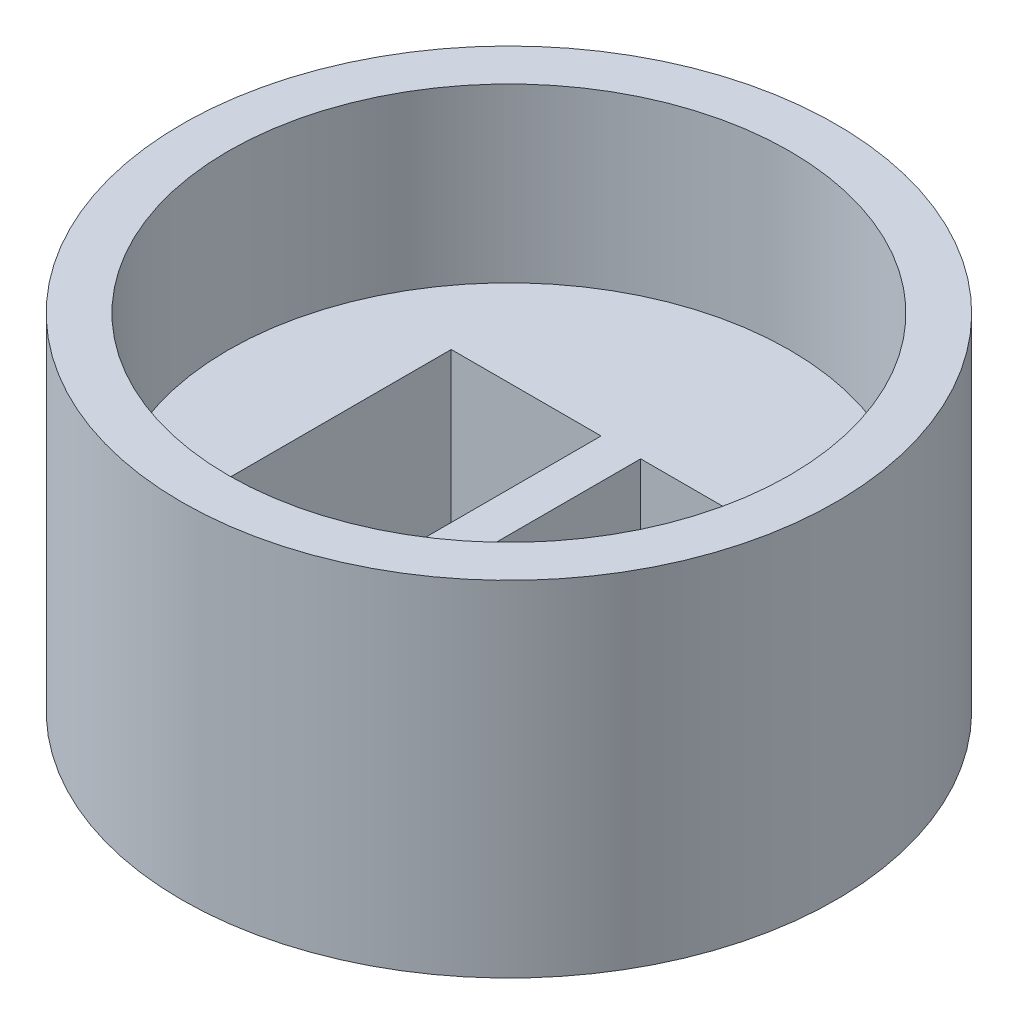
ISO-10303-21;
HEADER;
FILE_DESCRIPTION(('STEP AP214'),'2;1');
FILE_NAME('part.step','',(''),(''),'','','');
FILE_SCHEMA(('AUTOMOTIVE_DESIGN { 1 0 10303 214 1 1 1 1 }'));
ENDSEC;
DATA;
#1=APPLICATION_CONTEXT('core data for automotive mechanical design processes');
#2=APPLICATION_PROTOCOL_DEFINITION('international standard','automotive_design',2000,#1);
#3=PRODUCT_CONTEXT('',#1,'mechanical');
#4=PRODUCT('Part','Part','',(#3));
#5=PRODUCT_RELATED_PRODUCT_CATEGORY('part','',(#4));
#6=PRODUCT_DEFINITION_FORMATION('','',#4);
#7=PRODUCT_DEFINITION_CONTEXT('part definition',#1,'design');
#8=PRODUCT_DEFINITION('design','',#6,#7);
#9=PRODUCT_DEFINITION_SHAPE('','',#8);
#10=(LENGTH_UNIT() NAMED_UNIT(*) SI_UNIT(.MILLI.,.METRE.));
#11=(NAMED_UNIT(*) PLANE_ANGLE_UNIT() SI_UNIT($,.RADIAN.));
#12=(NAMED_UNIT(*) SI_UNIT($,.STERADIAN.) SOLID_ANGLE_UNIT());
#13=UNCERTAINTY_MEASURE_WITH_UNIT(LENGTH_MEASURE(1.E-05),#10,'distance_accuracy_value','');
#14=(GEOMETRIC_REPRESENTATION_CONTEXT(3) GLOBAL_UNCERTAINTY_ASSIGNED_CONTEXT((#13)) GLOBAL_UNIT_ASSIGNED_CONTEXT((#10,
#11,#12)) REPRESENTATION_CONTEXT('',''));
#15=CARTESIAN_POINT('',(0.,0.,0.));
#16=DIRECTION('',(0.,0.,1.));
#17=DIRECTION('',(1.,0.,0.));
#18=AXIS2_PLACEMENT_3D('',#15,#16,#17);
#19=CARTESIAN_POINT('',(0.,10.,0.));
#20=DIRECTION('',(0.,-1.,0.));
#21=DIRECTION('',(0.,0.,-1.));
#22=AXIS2_PLACEMENT_3D('',#19,#20,#21);
#23=CYLINDRICAL_SURFACE('',#22,9.5);
#24=CARTESIAN_POINT('',(0.,10.,0.));
#25=DIRECTION('',(0.,1.,0.));
#26=DIRECTION('',(0.,0.,1.));
#27=AXIS2_PLACEMENT_3D('',#24,#25,#26);
#28=CIRCLE('',#27,9.5);
#29=CARTESIAN_POINT('',(0.,10.,9.5));
#30=VERTEX_POINT('',#29);
#31=EDGE_CURVE('E11',#30,#30,#28,.T.);
#32=ORIENTED_EDGE('',*,*,#31,.F.);
#33=EDGE_LOOP('',(#32));
#34=FACE_BOUND('',#33,.T.);
#35=CARTESIAN_POINT('',(0.,0.,0.));
#36=DIRECTION('',(0.,1.,0.));
#37=DIRECTION('',(0.,0.,1.));
#38=AXIS2_PLACEMENT_3D('',#35,#36,#37);
#39=CIRCLE('',#38,9.5);
#40=CARTESIAN_POINT('',(0.,0.,9.5));
#41=VERTEX_POINT('',#40);
#42=EDGE_CURVE('E38',#41,#41,#39,.T.);
#43=ORIENTED_EDGE('',*,*,#42,.T.);
#44=EDGE_LOOP('',(#43));
#45=FACE_BOUND('',#44,.T.);
#46=ADVANCED_FACE('F35',(#34,#45),#23,.T.);
#47=CARTESIAN_POINT('',(0.,10.,0.));
#48=DIRECTION('',(0.,1.,0.));
#49=DIRECTION('',(0.,0.,1.));
#50=AXIS2_PLACEMENT_3D('',#47,#48,#49);
#51=PLANE('',#50);
#52=CARTESIAN_POINT('',(0.,10.,0.));
#53=DIRECTION('',(0.,1.,0.));
#54=DIRECTION('',(0.,0.,1.));
#55=AXIS2_PLACEMENT_3D('',#52,#53,#54);
#56=CIRCLE('',#55,8.15);
#57=CARTESIAN_POINT('',(0.,10.,8.15));
#58=VERTEX_POINT('',#57);
#59=EDGE_CURVE('E161',#58,#58,#56,.T.);
#60=ORIENTED_EDGE('',*,*,#59,.F.);
#61=EDGE_LOOP('',(#60));
#62=FACE_BOUND('',#61,.T.);
#63=ORIENTED_EDGE('',*,*,#31,.T.);
#64=EDGE_LOOP('',(#63));
#65=FACE_BOUND('',#64,.T.);
#66=ADVANCED_FACE('F176',(#62,#65),#51,.T.);
#67=CARTESIAN_POINT('',(0.,0.,0.));
#68=DIRECTION('',(0.,1.,0.));
#69=DIRECTION('',(0.,0.,1.));
#70=AXIS2_PLACEMENT_3D('',#67,#68,#69);
#71=PLANE('',#70);
#72=DIRECTION('',(1.,0.,0.));
#73=VECTOR('',#72,1.);
#74=CARTESIAN_POINT('',(-4.925,0.,3.25));
#75=LINE('',#74,#73);
#76=CARTESIAN_POINT('',(-4.925,0.,3.25));
#77=VERTEX_POINT('',#76);
#78=CARTESIAN_POINT('',(-0.575,0.,3.25));
#79=VERTEX_POINT('',#78);
#80=EDGE_CURVE('E107',#77,#79,#75,.T.);
#81=ORIENTED_EDGE('',*,*,#80,.T.);
#82=DIRECTION('',(0.,0.,-1.));
#83=VECTOR('',#82,1.);
#84=CARTESIAN_POINT('',(-0.575000000000001,0.,-3.25));
#85=LINE('',#84,#83);
#86=CARTESIAN_POINT('',(-0.575000000000001,0.,-3.25));
#87=VERTEX_POINT('',#86);
#88=EDGE_CURVE('E101',#79,#87,#85,.T.);
#89=ORIENTED_EDGE('',*,*,#88,.T.);
#90=DIRECTION('',(-1.,0.,0.));
#91=VECTOR('',#90,1.);
#92=CARTESIAN_POINT('',(-4.925,0.,-3.25));
#93=LINE('',#92,#91);
#94=CARTESIAN_POINT('',(-4.925,0.,-3.25));
#95=VERTEX_POINT('',#94);
#96=EDGE_CURVE('E110',#87,#95,#93,.T.);
#97=ORIENTED_EDGE('',*,*,#96,.T.);
#98=DIRECTION('',(0.,0.,1.));
#99=VECTOR('',#98,1.);
#100=CARTESIAN_POINT('',(-4.925,0.,-3.25));
#101=LINE('',#100,#99);
#102=EDGE_CURVE('E49',#95,#77,#101,.T.);
#103=ORIENTED_EDGE('',*,*,#102,.T.);
#104=EDGE_LOOP('',(#81,#89,#97,#103));
#105=FACE_BOUND('',#104,.T.);
#106=DIRECTION('',(-1.,0.,0.));
#107=VECTOR('',#106,1.);
#108=CARTESIAN_POINT('',(4.925,0.,-3.25));
#109=LINE('',#108,#107);
#110=CARTESIAN_POINT('',(4.925,0.,-3.25));
#111=VERTEX_POINT('',#110);
#112=CARTESIAN_POINT('',(0.575000000000001,0.,-3.25));
#113=VERTEX_POINT('',#112);
#114=EDGE_CURVE('E146',#111,#113,#109,.T.);
#115=ORIENTED_EDGE('',*,*,#114,.T.);
#116=DIRECTION('',(0.,0.,1.));
#117=VECTOR('',#116,1.);
#118=CARTESIAN_POINT('',(0.575000000000001,0.,3.25));
#119=LINE('',#118,#117);
#120=CARTESIAN_POINT('',(0.575000000000001,0.,3.25));
#121=VERTEX_POINT('',#120);
#122=EDGE_CURVE('E136',#113,#121,#119,.T.);
#123=ORIENTED_EDGE('',*,*,#122,.T.);
#124=DIRECTION('',(1.,0.,0.));
#125=VECTOR('',#124,1.);
#126=CARTESIAN_POINT('',(4.925,0.,3.25));
#127=LINE('',#126,#125);
#128=CARTESIAN_POINT('',(4.925,0.,3.25));
#129=VERTEX_POINT('',#128);
#130=EDGE_CURVE('E139',#121,#129,#127,.T.);
#131=ORIENTED_EDGE('',*,*,#130,.T.);
#132=DIRECTION('',(0.,0.,-1.));
#133=VECTOR('',#132,1.);
#134=CARTESIAN_POINT('',(4.925,0.,3.25));
#135=LINE('',#134,#133);
#136=EDGE_CURVE('E143',#129,#111,#135,.T.);
#137=ORIENTED_EDGE('',*,*,#136,.T.);
#138=EDGE_LOOP('',(#115,#123,#131,#137));
#139=FACE_BOUND('',#138,.T.);
#140=ORIENTED_EDGE('',*,*,#42,.F.);
#141=EDGE_LOOP('',(#140));
#142=FACE_BOUND('',#141,.T.);
#143=ADVANCED_FACE('F114',(#105,#139,#142),#71,.F.);
#144=CARTESIAN_POINT('',(0.,5.,0.));
#145=DIRECTION('',(0.,1.,0.));
#146=DIRECTION('',(0.,0.,1.));
#147=AXIS2_PLACEMENT_3D('',#144,#145,#146);
#148=CYLINDRICAL_SURFACE('',#147,8.15);
#149=CARTESIAN_POINT('',(0.,5.,0.));
#150=DIRECTION('',(0.,1.,0.));
#151=DIRECTION('',(0.,0.,1.));
#152=AXIS2_PLACEMENT_3D('',#149,#150,#151);
#153=CIRCLE('',#152,8.15);
#154=CARTESIAN_POINT('',(0.,5.,8.15));
#155=VERTEX_POINT('',#154);
#156=EDGE_CURVE('E168',#155,#155,#153,.T.);
#157=ORIENTED_EDGE('',*,*,#156,.F.);
#158=EDGE_LOOP('',(#157));
#159=FACE_BOUND('',#158,.T.);
#160=ORIENTED_EDGE('',*,*,#59,.T.);
#161=EDGE_LOOP('',(#160));
#162=FACE_BOUND('',#161,.T.);
#163=ADVANCED_FACE('F174',(#159,#162),#148,.F.);
#164=CARTESIAN_POINT('',(0.,5.,0.));
#165=DIRECTION('',(0.,1.,0.));
#166=DIRECTION('',(0.,0.,1.));
#167=AXIS2_PLACEMENT_3D('',#164,#165,#166);
#168=PLANE('',#167);
#169=DIRECTION('',(0.,0.,-1.));
#170=VECTOR('',#169,1.);
#171=CARTESIAN_POINT('',(-0.575000000000001,5.,-3.25));
#172=LINE('',#171,#170);
#173=CARTESIAN_POINT('',(-0.575,5.,3.25));
#174=VERTEX_POINT('',#173);
#175=CARTESIAN_POINT('',(-0.575000000000001,5.,-3.25));
#176=VERTEX_POINT('',#175);
#177=EDGE_CURVE('E57',#174,#176,#172,.T.);
#178=ORIENTED_EDGE('',*,*,#177,.F.);
#179=DIRECTION('',(1.,0.,0.));
#180=VECTOR('',#179,1.);
#181=CARTESIAN_POINT('',(-4.925,5.,3.25));
#182=LINE('',#181,#180);
#183=CARTESIAN_POINT('',(-4.925,5.,3.25));
#184=VERTEX_POINT('',#183);
#185=EDGE_CURVE('E117',#184,#174,#182,.T.);
#186=ORIENTED_EDGE('',*,*,#185,.F.);
#187=DIRECTION('',(0.,0.,1.));
#188=VECTOR('',#187,1.);
#189=CARTESIAN_POINT('',(-4.925,5.,-3.25));
#190=LINE('',#189,#188);
#191=CARTESIAN_POINT('',(-4.925,5.,-3.25));
#192=VERTEX_POINT('',#191);
#193=EDGE_CURVE('E120',#192,#184,#190,.T.);
#194=ORIENTED_EDGE('',*,*,#193,.F.);
#195=DIRECTION('',(-1.,0.,0.));
#196=VECTOR('',#195,1.);
#197=CARTESIAN_POINT('',(-4.925,5.,-3.25));
#198=LINE('',#197,#196);
#199=EDGE_CURVE('E126',#176,#192,#198,.T.);
#200=ORIENTED_EDGE('',*,*,#199,.F.);
#201=EDGE_LOOP('',(#178,#186,#194,#200));
#202=FACE_BOUND('',#201,.T.);
#203=DIRECTION('',(0.,0.,1.));
#204=VECTOR('',#203,1.);
#205=CARTESIAN_POINT('',(0.575000000000001,5.,3.25));
#206=LINE('',#205,#204);
#207=CARTESIAN_POINT('',(0.575000000000001,5.,-3.25));
#208=VERTEX_POINT('',#207);
#209=CARTESIAN_POINT('',(0.575000000000001,5.,3.25));
#210=VERTEX_POINT('',#209);
#211=EDGE_CURVE('E132',#208,#210,#206,.T.);
#212=ORIENTED_EDGE('',*,*,#211,.F.);
#213=DIRECTION('',(-1.,0.,0.));
#214=VECTOR('',#213,1.);
#215=CARTESIAN_POINT('',(4.925,5.,-3.25));
#216=LINE('',#215,#214);
#217=CARTESIAN_POINT('',(4.925,5.,-3.25));
#218=VERTEX_POINT('',#217);
#219=EDGE_CURVE('E140',#218,#208,#216,.T.);
#220=ORIENTED_EDGE('',*,*,#219,.F.);
#221=DIRECTION('',(0.,0.,-1.));
#222=VECTOR('',#221,1.);
#223=CARTESIAN_POINT('',(4.925,5.,3.25));
#224=LINE('',#223,#222);
#225=CARTESIAN_POINT('',(4.925,5.,3.25));
#226=VERTEX_POINT('',#225);
#227=EDGE_CURVE('E154',#226,#218,#224,.T.);
#228=ORIENTED_EDGE('',*,*,#227,.F.);
#229=DIRECTION('',(1.,0.,0.));
#230=VECTOR('',#229,1.);
#231=CARTESIAN_POINT('',(4.925,5.,3.25));
#232=LINE('',#231,#230);
#233=EDGE_CURVE('E151',#210,#226,#232,.T.);
#234=ORIENTED_EDGE('',*,*,#233,.F.);
#235=EDGE_LOOP('',(#212,#220,#228,#234));
#236=FACE_BOUND('',#235,.T.);
#237=ORIENTED_EDGE('',*,*,#156,.T.);
#238=EDGE_LOOP('',(#237));
#239=FACE_BOUND('',#238,.T.);
#240=ADVANCED_FACE('F191',(#202,#236,#239),#168,.T.);
#241=CARTESIAN_POINT('',(0.575000000000001,0.,3.25));
#242=DIRECTION('',(-1.,0.,0.));
#243=DIRECTION('',(0.,0.,1.));
#244=AXIS2_PLACEMENT_3D('',#241,#242,#243);
#245=PLANE('',#244);
#246=ORIENTED_EDGE('',*,*,#211,.T.);
#247=DIRECTION('',(0.,1.,0.));
#248=VECTOR('',#247,1.);
#249=CARTESIAN_POINT('',(0.575000000000001,0.,3.25));
#250=LINE('',#249,#248);
#251=EDGE_CURVE('E149',#121,#210,#250,.T.);
#252=ORIENTED_EDGE('',*,*,#251,.F.);
#253=ORIENTED_EDGE('',*,*,#122,.F.);
#254=DIRECTION('',(0.,1.,0.));
#255=VECTOR('',#254,1.);
#256=CARTESIAN_POINT('',(0.575000000000001,0.,-3.25));
#257=LINE('',#256,#255);
#258=EDGE_CURVE('E159',#113,#208,#257,.T.);
#259=ORIENTED_EDGE('',*,*,#258,.T.);
#260=EDGE_LOOP('',(#246,#252,#253,#259));
#261=FACE_BOUND('',#260,.T.);
#262=ADVANCED_FACE('F197',(#261),#245,.F.);
#263=CARTESIAN_POINT('',(4.925,0.,-3.25));
#264=DIRECTION('',(0.,0.,-1.));
#265=DIRECTION('',(-1.,0.,0.));
#266=AXIS2_PLACEMENT_3D('',#263,#264,#265);
#267=PLANE('',#266);
#268=ORIENTED_EDGE('',*,*,#219,.T.);
#269=ORIENTED_EDGE('',*,*,#258,.F.);
#270=ORIENTED_EDGE('',*,*,#114,.F.);
#271=DIRECTION('',(0.,1.,0.));
#272=VECTOR('',#271,1.);
#273=CARTESIAN_POINT('',(4.925,0.,-3.25));
#274=LINE('',#273,#272);
#275=EDGE_CURVE('E162',#111,#218,#274,.T.);
#276=ORIENTED_EDGE('',*,*,#275,.T.);
#277=EDGE_LOOP('',(#268,#269,#270,#276));
#278=FACE_BOUND('',#277,.T.);
#279=ADVANCED_FACE('F201',(#278),#267,.F.);
#280=CARTESIAN_POINT('',(4.925,0.,3.25));
#281=DIRECTION('',(1.,0.,0.));
#282=DIRECTION('',(0.,0.,-1.));
#283=AXIS2_PLACEMENT_3D('',#280,#281,#282);
#284=PLANE('',#283);
#285=ORIENTED_EDGE('',*,*,#227,.T.);
#286=ORIENTED_EDGE('',*,*,#275,.F.);
#287=ORIENTED_EDGE('',*,*,#136,.F.);
#288=DIRECTION('',(0.,1.,0.));
#289=VECTOR('',#288,1.);
#290=CARTESIAN_POINT('',(4.925,0.,3.25));
#291=LINE('',#290,#289);
#292=EDGE_CURVE('E164',#129,#226,#291,.T.);
#293=ORIENTED_EDGE('',*,*,#292,.T.);
#294=EDGE_LOOP('',(#285,#286,#287,#293));
#295=FACE_BOUND('',#294,.T.);
#296=ADVANCED_FACE('F206',(#295),#284,.F.);
#297=CARTESIAN_POINT('',(4.925,0.,3.25));
#298=DIRECTION('',(0.,0.,1.));
#299=DIRECTION('',(1.,0.,0.));
#300=AXIS2_PLACEMENT_3D('',#297,#298,#299);
#301=PLANE('',#300);
#302=ORIENTED_EDGE('',*,*,#233,.T.);
#303=ORIENTED_EDGE('',*,*,#292,.F.);
#304=ORIENTED_EDGE('',*,*,#130,.F.);
#305=ORIENTED_EDGE('',*,*,#251,.T.);
#306=EDGE_LOOP('',(#302,#303,#304,#305));
#307=FACE_BOUND('',#306,.T.);
#308=ADVANCED_FACE('F203',(#307),#301,.F.);
#309=CARTESIAN_POINT('',(-0.575000000000001,0.,-3.25));
#310=DIRECTION('',(1.,0.,0.));
#311=DIRECTION('',(0.,0.,-1.));
#312=AXIS2_PLACEMENT_3D('',#309,#310,#311);
#313=PLANE('',#312);
#314=ORIENTED_EDGE('',*,*,#177,.T.);
#315=DIRECTION('',(0.,1.,0.));
#316=VECTOR('',#315,1.);
#317=CARTESIAN_POINT('',(-0.575000000000001,0.,-3.25));
#318=LINE('',#317,#316);
#319=EDGE_CURVE('E97',#87,#176,#318,.T.);
#320=ORIENTED_EDGE('',*,*,#319,.F.);
#321=ORIENTED_EDGE('',*,*,#88,.F.);
#322=DIRECTION('',(0.,1.,0.));
#323=VECTOR('',#322,1.);
#324=CARTESIAN_POINT('',(-0.575,0.,3.25));
#325=LINE('',#324,#323);
#326=EDGE_CURVE('E130',#79,#174,#325,.T.);
#327=ORIENTED_EDGE('',*,*,#326,.T.);
#328=EDGE_LOOP('',(#314,#320,#321,#327));
#329=FACE_BOUND('',#328,.T.);
#330=ADVANCED_FACE('F99',(#329),#313,.F.);
#331=CARTESIAN_POINT('',(-4.925,0.,3.25));
#332=DIRECTION('',(0.,0.,1.));
#333=DIRECTION('',(1.,0.,0.));
#334=AXIS2_PLACEMENT_3D('',#331,#332,#333);
#335=PLANE('',#334);
#336=ORIENTED_EDGE('',*,*,#185,.T.);
#337=ORIENTED_EDGE('',*,*,#326,.F.);
#338=ORIENTED_EDGE('',*,*,#80,.F.);
#339=DIRECTION('',(0.,1.,0.));
#340=VECTOR('',#339,1.);
#341=CARTESIAN_POINT('',(-4.925,0.,3.25));
#342=LINE('',#341,#340);
#343=EDGE_CURVE('E133',#77,#184,#342,.T.);
#344=ORIENTED_EDGE('',*,*,#343,.T.);
#345=EDGE_LOOP('',(#336,#337,#338,#344));
#346=FACE_BOUND('',#345,.T.);
#347=ADVANCED_FACE('F216',(#346),#335,.F.);
#348=CARTESIAN_POINT('',(-4.925,0.,-3.25));
#349=DIRECTION('',(-1.,0.,0.));
#350=DIRECTION('',(0.,0.,1.));
#351=AXIS2_PLACEMENT_3D('',#348,#349,#350);
#352=PLANE('',#351);
#353=ORIENTED_EDGE('',*,*,#193,.T.);
#354=ORIENTED_EDGE('',*,*,#343,.F.);
#355=ORIENTED_EDGE('',*,*,#102,.F.);
#356=DIRECTION('',(0.,1.,0.));
#357=VECTOR('',#356,1.);
#358=CARTESIAN_POINT('',(-4.925,0.,-3.25));
#359=LINE('',#358,#357);
#360=EDGE_CURVE('E106',#95,#192,#359,.T.);
#361=ORIENTED_EDGE('',*,*,#360,.T.);
#362=EDGE_LOOP('',(#353,#354,#355,#361));
#363=FACE_BOUND('',#362,.T.);
#364=ADVANCED_FACE('F219',(#363),#352,.F.);
#365=CARTESIAN_POINT('',(-4.925,0.,-3.25));
#366=DIRECTION('',(0.,0.,-1.));
#367=DIRECTION('',(-1.,0.,0.));
#368=AXIS2_PLACEMENT_3D('',#365,#366,#367);
#369=PLANE('',#368);
#370=ORIENTED_EDGE('',*,*,#199,.T.);
#371=ORIENTED_EDGE('',*,*,#360,.F.);
#372=ORIENTED_EDGE('',*,*,#96,.F.);
#373=ORIENTED_EDGE('',*,*,#319,.T.);
#374=EDGE_LOOP('',(#370,#371,#372,#373));
#375=FACE_BOUND('',#374,.T.);
#376=ADVANCED_FACE('F111',(#375),#369,.F.);
#377=CLOSED_SHELL('',(#46,#66,#143,#163,#240,#262,#279,#296,#308,#330,#347,#364,#376));
#378=MANIFOLD_SOLID_BREP('B2',#377);
#379=ADVANCED_BREP_SHAPE_REPRESENTATION('',(#18,#378),#14);
#380=SHAPE_DEFINITION_REPRESENTATION(#9,#379);
ENDSEC;
END-ISO-10303-21;
